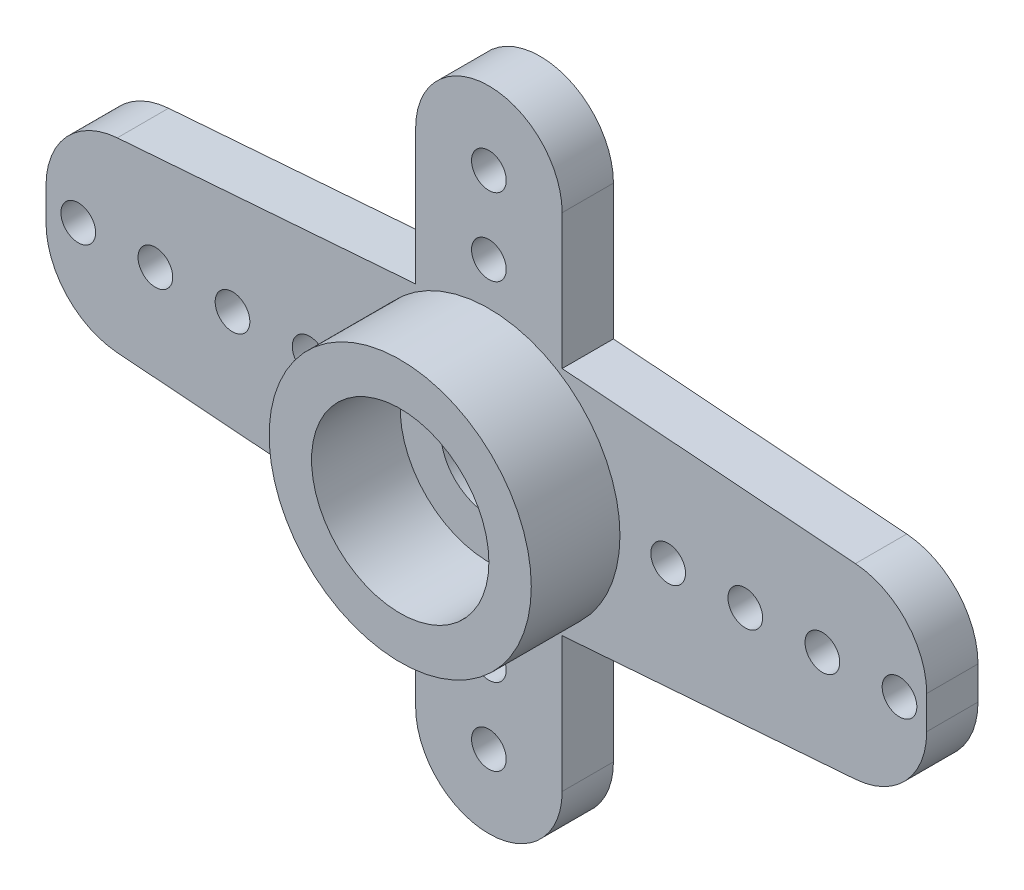
ISO-10303-21;
HEADER;
FILE_DESCRIPTION(('STEP AP214'),'2;1');
FILE_NAME('part.step','',(''),(''),'','','');
FILE_SCHEMA(('AUTOMOTIVE_DESIGN { 1 0 10303 214 1 1 1 1 }'));
ENDSEC;
DATA;
#1=APPLICATION_CONTEXT('core data for automotive mechanical design processes');
#2=APPLICATION_PROTOCOL_DEFINITION('international standard','automotive_design',2000,#1);
#3=PRODUCT_CONTEXT('',#1,'mechanical');
#4=PRODUCT('Part','Part','',(#3));
#5=PRODUCT_RELATED_PRODUCT_CATEGORY('part','',(#4));
#6=PRODUCT_DEFINITION_FORMATION('','',#4);
#7=PRODUCT_DEFINITION_CONTEXT('part definition',#1,'design');
#8=PRODUCT_DEFINITION('design','',#6,#7);
#9=PRODUCT_DEFINITION_SHAPE('','',#8);
#10=(LENGTH_UNIT() NAMED_UNIT(*) SI_UNIT(.MILLI.,.METRE.));
#11=(NAMED_UNIT(*) PLANE_ANGLE_UNIT() SI_UNIT($,.RADIAN.));
#12=(NAMED_UNIT(*) SI_UNIT($,.STERADIAN.) SOLID_ANGLE_UNIT());
#13=UNCERTAINTY_MEASURE_WITH_UNIT(LENGTH_MEASURE(1.E-05),#10,'distance_accuracy_value','');
#14=(GEOMETRIC_REPRESENTATION_CONTEXT(3) GLOBAL_UNCERTAINTY_ASSIGNED_CONTEXT((#13)) GLOBAL_UNIT_ASSIGNED_CONTEXT((#10,
#11,#12)) REPRESENTATION_CONTEXT('',''));
#15=CARTESIAN_POINT('',(0.,0.,0.));
#16=DIRECTION('',(0.,0.,1.));
#17=DIRECTION('',(1.,0.,0.));
#18=AXIS2_PLACEMENT_3D('',#15,#16,#17);
#19=CARTESIAN_POINT('',(0.,0.,0.));
#20=DIRECTION('',(0.,0.,1.));
#21=DIRECTION('',(1.,0.,0.));
#22=AXIS2_PLACEMENT_3D('',#19,#20,#21);
#23=CYLINDRICAL_SURFACE('',#22,1.25);
#24=CARTESIAN_POINT('',(0.,0.,1.33));
#25=DIRECTION('',(0.,0.,1.));
#26=DIRECTION('',(1.,0.,0.));
#27=AXIS2_PLACEMENT_3D('',#24,#25,#26);
#28=CIRCLE('',#27,1.25);
#29=CARTESIAN_POINT('',(1.25,0.,1.33));
#30=VERTEX_POINT('',#29);
#31=EDGE_CURVE('E276',#30,#30,#28,.T.);
#32=ORIENTED_EDGE('',*,*,#31,.T.);
#33=EDGE_LOOP('',(#32));
#34=FACE_BOUND('',#33,.T.);
#35=CARTESIAN_POINT('',(0.,0.,1.1));
#36=DIRECTION('',(0.,0.,-1.));
#37=DIRECTION('',(-1.,0.,0.));
#38=AXIS2_PLACEMENT_3D('',#35,#36,#37);
#39=CIRCLE('',#38,1.25);
#40=CARTESIAN_POINT('',(-1.25,0.,1.1));
#41=VERTEX_POINT('',#40);
#42=EDGE_CURVE('E272',#41,#41,#39,.F.);
#43=ORIENTED_EDGE('',*,*,#42,.F.);
#44=EDGE_LOOP('',(#43));
#45=FACE_BOUND('',#44,.T.);
#46=ADVANCED_FACE('F40',(#34,#45),#23,.F.);
#47=CARTESIAN_POINT('',(-16.7919145803729,-1.86962168683336,1.33));
#48=DIRECTION('',(0.0756877761988721,0.997131566311121,0.));
#49=DIRECTION('',(-0.997131566311121,0.0756877761988721,0.));
#50=AXIS2_PLACEMENT_3D('',#47,#48,#49);
#51=PLANE('',#50);
#52=DIRECTION('',(0.997131566311121,-0.0756877761988721,0.));
#53=VECTOR('',#52,1.);
#54=CARTESIAN_POINT('',(-16.7919145803729,-1.86962168683336,1.33));
#55=LINE('',#54,#53);
#56=CARTESIAN_POINT('',(-9.63847364933361,-2.41260724113023,1.33));
#57=VERTEX_POINT('',#56);
#58=CARTESIAN_POINT('',(-1.90000000000001,-3.,1.33));
#59=VERTEX_POINT('',#58);
#60=EDGE_CURVE('E155',#57,#59,#55,.T.);
#61=ORIENTED_EDGE('',*,*,#60,.F.);
#62=DIRECTION('',(0.,0.,-1.));
#63=VECTOR('',#62,1.);
#64=CARTESIAN_POINT('',(-9.63847364933361,-2.41260724113023,1.33));
#65=LINE('',#64,#63);
#66=CARTESIAN_POINT('',(-9.63847364933361,-2.41260724113023,0.));
#67=VERTEX_POINT('',#66);
#68=EDGE_CURVE('E278',#57,#67,#65,.T.);
#69=ORIENTED_EDGE('',*,*,#68,.T.);
#70=DIRECTION('',(0.997131566311121,-0.0756877761988721,0.));
#71=VECTOR('',#70,1.);
#72=CARTESIAN_POINT('',(-16.7919145803729,-1.86962168683336,0.));
#73=LINE('',#72,#71);
#74=CARTESIAN_POINT('',(-1.90000000000001,-3.,0.));
#75=VERTEX_POINT('',#74);
#76=EDGE_CURVE('E175',#67,#75,#73,.T.);
#77=ORIENTED_EDGE('',*,*,#76,.T.);
#78=DIRECTION('',(0.,0.,-1.));
#79=VECTOR('',#78,1.);
#80=CARTESIAN_POINT('',(-1.90000000000001,-3.,1.33));
#81=LINE('',#80,#79);
#82=EDGE_CURVE('E172',#59,#75,#81,.T.);
#83=ORIENTED_EDGE('',*,*,#82,.F.);
#84=EDGE_LOOP('',(#61,#69,#77,#83));
#85=FACE_BOUND('',#84,.T.);
#86=ADVANCED_FACE('F173',(#85),#51,.F.);
#87=CARTESIAN_POINT('',(-1.90000000000001,-3.,1.33));
#88=DIRECTION('',(1.,0.,0.));
#89=DIRECTION('',(0.,1.,0.));
#90=AXIS2_PLACEMENT_3D('',#87,#88,#89);
#91=PLANE('',#90);
#92=DIRECTION('',(0.,-1.,0.));
#93=VECTOR('',#92,1.);
#94=CARTESIAN_POINT('',(-1.90000000000001,-3.,0.));
#95=LINE('',#94,#93);
#96=CARTESIAN_POINT('',(-1.9,-6.5,0.));
#97=VERTEX_POINT('',#96);
#98=EDGE_CURVE('E218',#75,#97,#95,.T.);
#99=ORIENTED_EDGE('',*,*,#98,.T.);
#100=DIRECTION('',(0.,0.,-1.));
#101=VECTOR('',#100,1.);
#102=CARTESIAN_POINT('',(-1.9,-6.5,1.33));
#103=LINE('',#102,#101);
#104=CARTESIAN_POINT('',(-1.9,-6.5,1.33));
#105=VERTEX_POINT('',#104);
#106=EDGE_CURVE('E180',#105,#97,#103,.T.);
#107=ORIENTED_EDGE('',*,*,#106,.F.);
#108=DIRECTION('',(0.,-1.,0.));
#109=VECTOR('',#108,1.);
#110=CARTESIAN_POINT('',(-1.90000000000001,-3.,1.33));
#111=LINE('',#110,#109);
#112=EDGE_CURVE('E161',#59,#105,#111,.T.);
#113=ORIENTED_EDGE('',*,*,#112,.F.);
#114=ORIENTED_EDGE('',*,*,#82,.T.);
#115=EDGE_LOOP('',(#99,#107,#113,#114));
#116=FACE_BOUND('',#115,.T.);
#117=ADVANCED_FACE('F182',(#116),#91,.F.);
#118=CARTESIAN_POINT('',(0.,-6.5,1.33));
#119=DIRECTION('',(0.,0.,-1.));
#120=DIRECTION('',(-1.,0.,0.));
#121=AXIS2_PLACEMENT_3D('',#118,#119,#120);
#122=CYLINDRICAL_SURFACE('',#121,1.9);
#123=CARTESIAN_POINT('',(0.,-6.5,0.));
#124=DIRECTION('',(0.,0.,1.));
#125=DIRECTION('',(-1.,0.,0.));
#126=AXIS2_PLACEMENT_3D('',#123,#124,#125);
#127=CIRCLE('',#126,1.9);
#128=CARTESIAN_POINT('',(1.9,-6.5,0.));
#129=VERTEX_POINT('',#128);
#130=EDGE_CURVE('E222',#97,#129,#127,.T.);
#131=ORIENTED_EDGE('',*,*,#130,.T.);
#132=DIRECTION('',(0.,0.,-1.));
#133=VECTOR('',#132,1.);
#134=CARTESIAN_POINT('',(1.9,-6.5,1.33));
#135=LINE('',#134,#133);
#136=CARTESIAN_POINT('',(1.9,-6.5,1.33));
#137=VERTEX_POINT('',#136);
#138=EDGE_CURVE('E266',#137,#129,#135,.T.);
#139=ORIENTED_EDGE('',*,*,#138,.F.);
#140=CARTESIAN_POINT('',(0.,-6.5,1.33));
#141=DIRECTION('',(0.,0.,1.));
#142=DIRECTION('',(-1.,0.,0.));
#143=AXIS2_PLACEMENT_3D('',#140,#141,#142);
#144=CIRCLE('',#143,1.9);
#145=EDGE_CURVE('E186',#105,#137,#144,.T.);
#146=ORIENTED_EDGE('',*,*,#145,.F.);
#147=ORIENTED_EDGE('',*,*,#106,.T.);
#148=EDGE_LOOP('',(#131,#139,#146,#147));
#149=FACE_BOUND('',#148,.T.);
#150=ADVANCED_FACE('F346',(#149),#122,.T.);
#151=CARTESIAN_POINT('',(1.89999999999999,-3.,1.33));
#152=DIRECTION('',(-1.,0.,0.));
#153=DIRECTION('',(0.,-1.,0.));
#154=AXIS2_PLACEMENT_3D('',#151,#152,#153);
#155=PLANE('',#154);
#156=DIRECTION('',(0.,1.,0.));
#157=VECTOR('',#156,1.);
#158=CARTESIAN_POINT('',(1.89999999999999,-3.,0.));
#159=LINE('',#158,#157);
#160=CARTESIAN_POINT('',(1.89999999999999,-3.,0.));
#161=VERTEX_POINT('',#160);
#162=EDGE_CURVE('E225',#129,#161,#159,.T.);
#163=ORIENTED_EDGE('',*,*,#162,.T.);
#164=DIRECTION('',(0.,0.,-1.));
#165=VECTOR('',#164,1.);
#166=CARTESIAN_POINT('',(1.89999999999999,-3.,1.33));
#167=LINE('',#166,#165);
#168=CARTESIAN_POINT('',(1.89999999999999,-3.,1.33));
#169=VERTEX_POINT('',#168);
#170=EDGE_CURVE('E262',#169,#161,#167,.T.);
#171=ORIENTED_EDGE('',*,*,#170,.F.);
#172=DIRECTION('',(0.,1.,0.));
#173=VECTOR('',#172,1.);
#174=CARTESIAN_POINT('',(1.89999999999999,-3.,1.33));
#175=LINE('',#174,#173);
#176=EDGE_CURVE('E189',#137,#169,#175,.T.);
#177=ORIENTED_EDGE('',*,*,#176,.F.);
#178=ORIENTED_EDGE('',*,*,#138,.T.);
#179=EDGE_LOOP('',(#163,#171,#177,#178));
#180=FACE_BOUND('',#179,.T.);
#181=ADVANCED_FACE('F342',(#180),#155,.F.);
#182=CARTESIAN_POINT('',(16.7919145803729,-1.86962168683335,1.33));
#183=DIRECTION('',(-0.0756877761988722,0.997131566311121,0.));
#184=DIRECTION('',(-0.997131566311121,-0.0756877761988722,0.));
#185=AXIS2_PLACEMENT_3D('',#182,#183,#184);
#186=PLANE('',#185);
#187=DIRECTION('',(0.997131566311121,0.0756877761988722,0.));
#188=VECTOR('',#187,1.);
#189=CARTESIAN_POINT('',(16.7919145803729,-1.86962168683335,0.));
#190=LINE('',#189,#188);
#191=CARTESIAN_POINT('',(9.50732764089362,-2.42256194527514,0.));
#192=VERTEX_POINT('',#191);
#193=EDGE_CURVE('E228',#161,#192,#190,.T.);
#194=ORIENTED_EDGE('',*,*,#193,.T.);
#195=DIRECTION('',(0.,0.,1.));
#196=VECTOR('',#195,1.);
#197=CARTESIAN_POINT('',(9.50732764089362,-2.42256194527514,1.33));
#198=LINE('',#197,#196);
#199=CARTESIAN_POINT('',(9.50732764089362,-2.42256194527514,1.33));
#200=VERTEX_POINT('',#199);
#201=EDGE_CURVE('E311',#192,#200,#198,.T.);
#202=ORIENTED_EDGE('',*,*,#201,.T.);
#203=DIRECTION('',(0.997131566311121,0.0756877761988722,0.));
#204=VECTOR('',#203,1.);
#205=CARTESIAN_POINT('',(16.7919145803729,-1.86962168683335,1.33));
#206=LINE('',#205,#204);
#207=EDGE_CURVE('E195',#169,#200,#206,.T.);
#208=ORIENTED_EDGE('',*,*,#207,.F.);
#209=ORIENTED_EDGE('',*,*,#170,.T.);
#210=EDGE_LOOP('',(#194,#202,#208,#209));
#211=FACE_BOUND('',#210,.T.);
#212=ADVANCED_FACE('F337',(#211),#186,.F.);
#213=CARTESIAN_POINT('',(16.7919145803729,1.86962168683335,1.33));
#214=DIRECTION('',(-0.0756877761988718,-0.997131566311121,0.));
#215=DIRECTION('',(0.997131566311121,-0.0756877761988718,0.));
#216=AXIS2_PLACEMENT_3D('',#213,#214,#215);
#217=PLANE('',#216);
#218=DIRECTION('',(-0.997131566311121,0.0756877761988718,0.));
#219=VECTOR('',#218,1.);
#220=CARTESIAN_POINT('',(16.7919145803729,1.86962168683335,1.33));
#221=LINE('',#220,#219);
#222=CARTESIAN_POINT('',(9.50732764089362,2.42256194527514,1.33));
#223=VERTEX_POINT('',#222);
#224=CARTESIAN_POINT('',(1.89999999999999,3.,1.33));
#225=VERTEX_POINT('',#224);
#226=EDGE_CURVE('E199',#223,#225,#221,.T.);
#227=ORIENTED_EDGE('',*,*,#226,.F.);
#228=DIRECTION('',(0.,0.,-1.));
#229=VECTOR('',#228,1.);
#230=CARTESIAN_POINT('',(9.50732764089362,2.42256194527514,1.33));
#231=LINE('',#230,#229);
#232=CARTESIAN_POINT('',(9.50732764089362,2.42256194527514,0.));
#233=VERTEX_POINT('',#232);
#234=EDGE_CURVE('E11',#223,#233,#231,.T.);
#235=ORIENTED_EDGE('',*,*,#234,.T.);
#236=DIRECTION('',(-0.997131566311121,0.0756877761988718,0.));
#237=VECTOR('',#236,1.);
#238=CARTESIAN_POINT('',(16.7919145803729,1.86962168683335,0.));
#239=LINE('',#238,#237);
#240=CARTESIAN_POINT('',(1.89999999999999,3.,0.));
#241=VERTEX_POINT('',#240);
#242=EDGE_CURVE('E232',#233,#241,#239,.T.);
#243=ORIENTED_EDGE('',*,*,#242,.T.);
#244=DIRECTION('',(0.,0.,-1.));
#245=VECTOR('',#244,1.);
#246=CARTESIAN_POINT('',(1.89999999999999,3.,1.33));
#247=LINE('',#246,#245);
#248=EDGE_CURVE('E258',#225,#241,#247,.T.);
#249=ORIENTED_EDGE('',*,*,#248,.F.);
#250=EDGE_LOOP('',(#227,#235,#243,#249));
#251=FACE_BOUND('',#250,.T.);
#252=ADVANCED_FACE('F401',(#251),#217,.F.);
#253=CARTESIAN_POINT('',(1.89999999999999,3.,1.33));
#254=DIRECTION('',(-1.,0.,0.));
#255=DIRECTION('',(0.,-1.,0.));
#256=AXIS2_PLACEMENT_3D('',#253,#254,#255);
#257=PLANE('',#256);
#258=DIRECTION('',(0.,1.,0.));
#259=VECTOR('',#258,1.);
#260=CARTESIAN_POINT('',(1.89999999999999,3.,0.));
#261=LINE('',#260,#259);
#262=CARTESIAN_POINT('',(1.9,6.5,0.));
#263=VERTEX_POINT('',#262);
#264=EDGE_CURVE('E235',#241,#263,#261,.T.);
#265=ORIENTED_EDGE('',*,*,#264,.T.);
#266=DIRECTION('',(0.,0.,-1.));
#267=VECTOR('',#266,1.);
#268=CARTESIAN_POINT('',(1.9,6.5,1.33));
#269=LINE('',#268,#267);
#270=CARTESIAN_POINT('',(1.9,6.5,1.33));
#271=VERTEX_POINT('',#270);
#272=EDGE_CURVE('E254',#271,#263,#269,.T.);
#273=ORIENTED_EDGE('',*,*,#272,.F.);
#274=DIRECTION('',(0.,1.,0.));
#275=VECTOR('',#274,1.);
#276=CARTESIAN_POINT('',(1.89999999999999,3.,1.33));
#277=LINE('',#276,#275);
#278=EDGE_CURVE('E202',#225,#271,#277,.T.);
#279=ORIENTED_EDGE('',*,*,#278,.F.);
#280=ORIENTED_EDGE('',*,*,#248,.T.);
#281=EDGE_LOOP('',(#265,#273,#279,#280));
#282=FACE_BOUND('',#281,.T.);
#283=ADVANCED_FACE('F397',(#282),#257,.F.);
#284=CARTESIAN_POINT('',(0.,6.5,1.33));
#285=DIRECTION('',(0.,0.,-1.));
#286=DIRECTION('',(-1.,0.,0.));
#287=AXIS2_PLACEMENT_3D('',#284,#285,#286);
#288=CYLINDRICAL_SURFACE('',#287,1.9);
#289=CARTESIAN_POINT('',(0.,6.5,0.));
#290=DIRECTION('',(0.,0.,1.));
#291=DIRECTION('',(1.,0.,0.));
#292=AXIS2_PLACEMENT_3D('',#289,#290,#291);
#293=CIRCLE('',#292,1.9);
#294=CARTESIAN_POINT('',(-1.9,6.5,0.));
#295=VERTEX_POINT('',#294);
#296=EDGE_CURVE('E238',#263,#295,#293,.T.);
#297=ORIENTED_EDGE('',*,*,#296,.T.);
#298=DIRECTION('',(0.,0.,-1.));
#299=VECTOR('',#298,1.);
#300=CARTESIAN_POINT('',(-1.9,6.5,1.33));
#301=LINE('',#300,#299);
#302=CARTESIAN_POINT('',(-1.9,6.5,1.33));
#303=VERTEX_POINT('',#302);
#304=EDGE_CURVE('E250',#303,#295,#301,.T.);
#305=ORIENTED_EDGE('',*,*,#304,.F.);
#306=CARTESIAN_POINT('',(0.,6.5,1.33));
#307=DIRECTION('',(0.,0.,1.));
#308=DIRECTION('',(1.,0.,0.));
#309=AXIS2_PLACEMENT_3D('',#306,#307,#308);
#310=CIRCLE('',#309,1.9);
#311=EDGE_CURVE('E205',#271,#303,#310,.T.);
#312=ORIENTED_EDGE('',*,*,#311,.F.);
#313=ORIENTED_EDGE('',*,*,#272,.T.);
#314=EDGE_LOOP('',(#297,#305,#312,#313));
#315=FACE_BOUND('',#314,.T.);
#316=ADVANCED_FACE('F393',(#315),#288,.T.);
#317=CARTESIAN_POINT('',(-1.90000000000001,3.,1.33));
#318=DIRECTION('',(1.,0.,0.));
#319=DIRECTION('',(0.,1.,0.));
#320=AXIS2_PLACEMENT_3D('',#317,#318,#319);
#321=PLANE('',#320);
#322=DIRECTION('',(0.,-1.,0.));
#323=VECTOR('',#322,1.);
#324=CARTESIAN_POINT('',(-1.90000000000001,3.,0.));
#325=LINE('',#324,#323);
#326=CARTESIAN_POINT('',(-1.90000000000001,3.,0.));
#327=VERTEX_POINT('',#326);
#328=EDGE_CURVE('E241',#295,#327,#325,.T.);
#329=ORIENTED_EDGE('',*,*,#328,.T.);
#330=DIRECTION('',(0.,0.,-1.));
#331=VECTOR('',#330,1.);
#332=CARTESIAN_POINT('',(-1.90000000000001,3.,1.33));
#333=LINE('',#332,#331);
#334=CARTESIAN_POINT('',(-1.90000000000001,3.,1.33));
#335=VERTEX_POINT('',#334);
#336=EDGE_CURVE('E215',#335,#327,#333,.T.);
#337=ORIENTED_EDGE('',*,*,#336,.F.);
#338=DIRECTION('',(0.,-1.,0.));
#339=VECTOR('',#338,1.);
#340=CARTESIAN_POINT('',(-1.90000000000001,3.,1.33));
#341=LINE('',#340,#339);
#342=EDGE_CURVE('E208',#303,#335,#341,.T.);
#343=ORIENTED_EDGE('',*,*,#342,.F.);
#344=ORIENTED_EDGE('',*,*,#304,.T.);
#345=EDGE_LOOP('',(#329,#337,#343,#344));
#346=FACE_BOUND('',#345,.T.);
#347=ADVANCED_FACE('F389',(#346),#321,.F.);
#348=CARTESIAN_POINT('',(-16.7919145803729,1.86962168683335,1.33));
#349=DIRECTION('',(0.0756877761988721,-0.997131566311121,0.));
#350=DIRECTION('',(0.997131566311121,0.0756877761988721,0.));
#351=AXIS2_PLACEMENT_3D('',#348,#349,#350);
#352=PLANE('',#351);
#353=DIRECTION('',(-0.997131566311121,-0.0756877761988721,0.));
#354=VECTOR('',#353,1.);
#355=CARTESIAN_POINT('',(-16.7919145803729,1.86962168683335,0.));
#356=LINE('',#355,#354);
#357=CARTESIAN_POINT('',(-9.63847364933361,2.41260724113022,0.));
#358=VERTEX_POINT('',#357);
#359=EDGE_CURVE('E169',#327,#358,#356,.T.);
#360=ORIENTED_EDGE('',*,*,#359,.T.);
#361=DIRECTION('',(0.,0.,1.));
#362=VECTOR('',#361,1.);
#363=CARTESIAN_POINT('',(-9.63847364933361,2.41260724113022,1.33));
#364=LINE('',#363,#362);
#365=CARTESIAN_POINT('',(-9.63847364933361,2.41260724113022,1.33));
#366=VERTEX_POINT('',#365);
#367=EDGE_CURVE('E308',#358,#366,#364,.T.);
#368=ORIENTED_EDGE('',*,*,#367,.T.);
#369=DIRECTION('',(-0.997131566311121,-0.0756877761988721,0.));
#370=VECTOR('',#369,1.);
#371=CARTESIAN_POINT('',(-16.7919145803729,1.86962168683335,1.33));
#372=LINE('',#371,#370);
#373=EDGE_CURVE('E211',#335,#366,#372,.T.);
#374=ORIENTED_EDGE('',*,*,#373,.F.);
#375=ORIENTED_EDGE('',*,*,#336,.T.);
#376=EDGE_LOOP('',(#360,#368,#374,#375));
#377=FACE_BOUND('',#376,.T.);
#378=ADVANCED_FACE('F383',(#377),#352,.F.);
#379=CARTESIAN_POINT('',(-16.65,0.,1.33));
#380=DIRECTION('',(0.,0.,1.));
#381=DIRECTION('',(1.,0.,0.));
#382=AXIS2_PLACEMENT_3D('',#379,#380,#381);
#383=PLANE('',#382);
#384=DIRECTION('',(0.,-1.,0.));
#385=VECTOR('',#384,1.);
#386=CARTESIAN_POINT('',(-11.4870980969359,-3.16862126096254,1.33));
#387=LINE('',#386,#385);
#388=CARTESIAN_POINT('',(-11.4870980969359,0.418344108507978,1.33));
#389=VERTEX_POINT('',#388);
#390=CARTESIAN_POINT('',(-11.4870980969359,-0.418344108507985,1.33));
#391=VERTEX_POINT('',#390);
#392=EDGE_CURVE('E332',#389,#391,#387,.T.);
#393=ORIENTED_EDGE('',*,*,#392,.T.);
#394=CARTESIAN_POINT('',(-9.48709809693587,-0.418344108507985,1.33));
#395=DIRECTION('',(0.,0.,1.));
#396=DIRECTION('',(1.,0.,0.));
#397=AXIS2_PLACEMENT_3D('',#394,#395,#396);
#398=CIRCLE('',#397,2.);
#399=EDGE_CURVE('E164',#391,#57,#398,.T.);
#400=ORIENTED_EDGE('',*,*,#399,.T.);
#401=ORIENTED_EDGE('',*,*,#60,.T.);
#402=ORIENTED_EDGE('',*,*,#112,.T.);
#403=ORIENTED_EDGE('',*,*,#145,.T.);
#404=ORIENTED_EDGE('',*,*,#176,.T.);
#405=ORIENTED_EDGE('',*,*,#207,.T.);
#406=CARTESIAN_POINT('',(9.35595208849588,-0.428298812652896,1.33));
#407=DIRECTION('',(0.,0.,1.));
#408=DIRECTION('',(1.,0.,0.));
#409=AXIS2_PLACEMENT_3D('',#406,#407,#408);
#410=CIRCLE('',#409,2.);
#411=CARTESIAN_POINT('',(11.3559520884959,-0.428298812652896,1.33));
#412=VERTEX_POINT('',#411);
#413=EDGE_CURVE('E56',#200,#412,#410,.T.);
#414=ORIENTED_EDGE('',*,*,#413,.T.);
#415=DIRECTION('',(0.,1.,0.));
#416=VECTOR('',#415,1.);
#417=CARTESIAN_POINT('',(11.3559520884959,-3.73506978721914,1.33));
#418=LINE('',#417,#416);
#419=CARTESIAN_POINT('',(11.3559520884959,0.428298812652893,1.33));
#420=VERTEX_POINT('',#419);
#421=EDGE_CURVE('E325',#412,#420,#418,.T.);
#422=ORIENTED_EDGE('',*,*,#421,.T.);
#423=CARTESIAN_POINT('',(9.35595208849588,0.428298812652893,1.33));
#424=DIRECTION('',(0.,0.,1.));
#425=DIRECTION('',(1.,0.,0.));
#426=AXIS2_PLACEMENT_3D('',#423,#424,#425);
#427=CIRCLE('',#426,2.);
#428=EDGE_CURVE('E299',#420,#223,#427,.T.);
#429=ORIENTED_EDGE('',*,*,#428,.T.);
#430=ORIENTED_EDGE('',*,*,#226,.T.);
#431=ORIENTED_EDGE('',*,*,#278,.T.);
#432=ORIENTED_EDGE('',*,*,#311,.T.);
#433=ORIENTED_EDGE('',*,*,#342,.T.);
#434=ORIENTED_EDGE('',*,*,#373,.T.);
#435=CARTESIAN_POINT('',(-9.48709809693587,0.418344108507978,1.33));
#436=DIRECTION('',(0.,0.,1.));
#437=DIRECTION('',(1.,0.,0.));
#438=AXIS2_PLACEMENT_3D('',#435,#436,#437);
#439=CIRCLE('',#438,2.);
#440=EDGE_CURVE('E64',#366,#389,#439,.T.);
#441=ORIENTED_EDGE('',*,*,#440,.T.);
#442=EDGE_LOOP('',(#393,#400,#401,#402,#403,#404,#405,#414,#422,#429,#430,#431,#432,#433,#434,#441));
#443=FACE_BOUND('',#442,.T.);
#444=CARTESIAN_POINT('',(0.,6.5,1.33));
#445=DIRECTION('',(0.,0.,1.));
#446=DIRECTION('',(1.,0.,0.));
#447=AXIS2_PLACEMENT_3D('',#444,#445,#446);
#448=CIRCLE('',#447,0.45);
#449=CARTESIAN_POINT('',(0.449999999999998,6.5,1.33));
#450=VERTEX_POINT('',#449);
#451=EDGE_CURVE('E728',#450,#450,#448,.T.);
#452=ORIENTED_EDGE('',*,*,#451,.F.);
#453=EDGE_LOOP('',(#452));
#454=FACE_BOUND('',#453,.T.);
#455=CARTESIAN_POINT('',(10.65,0.,1.33));
#456=DIRECTION('',(0.,0.,1.));
#457=DIRECTION('',(-1.,0.,0.));
#458=AXIS2_PLACEMENT_3D('',#455,#456,#457);
#459=CIRCLE('',#458,0.449999999999998);
#460=CARTESIAN_POINT('',(10.2,0.,1.33));
#461=VERTEX_POINT('',#460);
#462=EDGE_CURVE('E778',#461,#461,#459,.T.);
#463=ORIENTED_EDGE('',*,*,#462,.F.);
#464=EDGE_LOOP('',(#463));
#465=FACE_BOUND('',#464,.T.);
#466=CARTESIAN_POINT('',(8.65000000000001,0.,1.33));
#467=DIRECTION('',(0.,0.,1.));
#468=DIRECTION('',(-1.,0.,0.));
#469=AXIS2_PLACEMENT_3D('',#466,#467,#468);
#470=CIRCLE('',#469,0.449999999999998);
#471=CARTESIAN_POINT('',(8.20000000000001,0.,1.33));
#472=VERTEX_POINT('',#471);
#473=EDGE_CURVE('E770',#472,#472,#470,.T.);
#474=ORIENTED_EDGE('',*,*,#473,.F.);
#475=EDGE_LOOP('',(#474));
#476=FACE_BOUND('',#475,.T.);
#477=CARTESIAN_POINT('',(6.65,0.,1.33));
#478=DIRECTION('',(0.,0.,1.));
#479=DIRECTION('',(-1.,0.,0.));
#480=AXIS2_PLACEMENT_3D('',#477,#478,#479);
#481=CIRCLE('',#480,0.449999999999998);
#482=CARTESIAN_POINT('',(6.20000000000001,0.,1.33));
#483=VERTEX_POINT('',#482);
#484=EDGE_CURVE('E762',#483,#483,#481,.T.);
#485=ORIENTED_EDGE('',*,*,#484,.F.);
#486=EDGE_LOOP('',(#485));
#487=FACE_BOUND('',#486,.T.);
#488=CARTESIAN_POINT('',(4.65,0.,1.33));
#489=DIRECTION('',(0.,0.,1.));
#490=DIRECTION('',(-1.,0.,0.));
#491=AXIS2_PLACEMENT_3D('',#488,#489,#490);
#492=CIRCLE('',#491,0.449999999999998);
#493=CARTESIAN_POINT('',(4.20000000000001,0.,1.33));
#494=VERTEX_POINT('',#493);
#495=EDGE_CURVE('E754',#494,#494,#492,.T.);
#496=ORIENTED_EDGE('',*,*,#495,.F.);
#497=EDGE_LOOP('',(#496));
#498=FACE_BOUND('',#497,.T.);
#499=CARTESIAN_POINT('',(0.,-6.5,1.33));
#500=DIRECTION('',(0.,0.,1.));
#501=DIRECTION('',(-1.,0.,0.));
#502=AXIS2_PLACEMENT_3D('',#499,#500,#501);
#503=CIRCLE('',#502,0.45);
#504=CARTESIAN_POINT('',(-0.449999999999997,-6.5,1.33));
#505=VERTEX_POINT('',#504);
#506=EDGE_CURVE('E746',#505,#505,#503,.T.);
#507=ORIENTED_EDGE('',*,*,#506,.F.);
#508=EDGE_LOOP('',(#507));
#509=FACE_BOUND('',#508,.T.);
#510=CARTESIAN_POINT('',(0.,-4.5,1.33));
#511=DIRECTION('',(0.,0.,1.));
#512=DIRECTION('',(-1.,0.,0.));
#513=AXIS2_PLACEMENT_3D('',#510,#511,#512);
#514=CIRCLE('',#513,0.45);
#515=CARTESIAN_POINT('',(-0.449999999999978,-4.5,1.33));
#516=VERTEX_POINT('',#515);
#517=EDGE_CURVE('E738',#516,#516,#514,.T.);
#518=ORIENTED_EDGE('',*,*,#517,.F.);
#519=EDGE_LOOP('',(#518));
#520=FACE_BOUND('',#519,.T.);
#521=CARTESIAN_POINT('',(0.,4.5,1.33));
#522=DIRECTION('',(0.,0.,1.));
#523=DIRECTION('',(1.,0.,0.));
#524=AXIS2_PLACEMENT_3D('',#521,#522,#523);
#525=CIRCLE('',#524,0.45);
#526=CARTESIAN_POINT('',(0.450000000000019,4.5,1.33));
#527=VERTEX_POINT('',#526);
#528=EDGE_CURVE('E786',#527,#527,#525,.T.);
#529=ORIENTED_EDGE('',*,*,#528,.F.);
#530=EDGE_LOOP('',(#529));
#531=FACE_BOUND('',#530,.T.);
#532=CARTESIAN_POINT('',(-10.65,0.,1.33));
#533=DIRECTION('',(0.,0.,1.));
#534=DIRECTION('',(1.,0.,0.));
#535=AXIS2_PLACEMENT_3D('',#532,#533,#534);
#536=CIRCLE('',#535,0.449999999999998);
#537=CARTESIAN_POINT('',(-10.2,0.,1.33));
#538=VERTEX_POINT('',#537);
#539=EDGE_CURVE('E787',#538,#538,#536,.T.);
#540=ORIENTED_EDGE('',*,*,#539,.F.);
#541=EDGE_LOOP('',(#540));
#542=FACE_BOUND('',#541,.T.);
#543=CARTESIAN_POINT('',(-8.65000000000001,0.,1.33));
#544=DIRECTION('',(0.,0.,1.));
#545=DIRECTION('',(1.,0.,0.));
#546=AXIS2_PLACEMENT_3D('',#543,#544,#545);
#547=CIRCLE('',#546,0.449999999999998);
#548=CARTESIAN_POINT('',(-8.20000000000001,0.,1.33));
#549=VERTEX_POINT('',#548);
#550=EDGE_CURVE('E795',#549,#549,#547,.T.);
#551=ORIENTED_EDGE('',*,*,#550,.F.);
#552=EDGE_LOOP('',(#551));
#553=FACE_BOUND('',#552,.T.);
#554=CARTESIAN_POINT('',(-6.65,0.,1.33));
#555=DIRECTION('',(0.,0.,1.));
#556=DIRECTION('',(1.,0.,0.));
#557=AXIS2_PLACEMENT_3D('',#554,#555,#556);
#558=CIRCLE('',#557,0.449999999999998);
#559=CARTESIAN_POINT('',(-6.20000000000001,0.,1.33));
#560=VERTEX_POINT('',#559);
#561=EDGE_CURVE('E803',#560,#560,#558,.T.);
#562=ORIENTED_EDGE('',*,*,#561,.F.);
#563=EDGE_LOOP('',(#562));
#564=FACE_BOUND('',#563,.T.);
#565=CARTESIAN_POINT('',(-4.65,0.,1.33));
#566=DIRECTION('',(0.,0.,1.));
#567=DIRECTION('',(1.,0.,0.));
#568=AXIS2_PLACEMENT_3D('',#565,#566,#567);
#569=CIRCLE('',#568,0.449999999999998);
#570=CARTESIAN_POINT('',(-4.20000000000001,0.,1.33));
#571=VERTEX_POINT('',#570);
#572=EDGE_CURVE('E737',#571,#571,#569,.T.);
#573=ORIENTED_EDGE('',*,*,#572,.F.);
#574=EDGE_LOOP('',(#573));
#575=FACE_BOUND('',#574,.T.);
#576=CARTESIAN_POINT('',(0.,0.,1.33));
#577=DIRECTION('',(0.,0.,1.));
#578=DIRECTION('',(1.,0.,0.));
#579=AXIS2_PLACEMENT_3D('',#576,#577,#578);
#580=CIRCLE('',#579,3.4);
#581=CARTESIAN_POINT('',(3.4,0.,1.33));
#582=VERTEX_POINT('',#581);
#583=EDGE_CURVE('E179',#582,#582,#580,.T.);
#584=ORIENTED_EDGE('',*,*,#583,.F.);
#585=EDGE_LOOP('',(#584));
#586=FACE_BOUND('',#585,.T.);
#587=ADVANCED_FACE('F158',(#443,#454,#465,#476,#487,#498,#509,#520,#531,#542,#553,#564,#575,
#586),#383,.T.);
#588=CARTESIAN_POINT('',(-16.65,0.,0.));
#589=DIRECTION('',(0.,0.,1.));
#590=DIRECTION('',(1.,0.,0.));
#591=AXIS2_PLACEMENT_3D('',#588,#589,#590);
#592=PLANE('',#591);
#593=CARTESIAN_POINT('',(0.,6.5,0.));
#594=DIRECTION('',(0.,0.,1.));
#595=DIRECTION('',(1.,0.,0.));
#596=AXIS2_PLACEMENT_3D('',#593,#594,#595);
#597=CIRCLE('',#596,0.45);
#598=CARTESIAN_POINT('',(0.449999999999998,6.5,0.));
#599=VERTEX_POINT('',#598);
#600=EDGE_CURVE('E723',#599,#599,#597,.T.);
#601=ORIENTED_EDGE('',*,*,#600,.T.);
#602=EDGE_LOOP('',(#601));
#603=FACE_BOUND('',#602,.T.);
#604=CARTESIAN_POINT('',(10.65,0.,0.));
#605=DIRECTION('',(0.,0.,1.));
#606=DIRECTION('',(-1.,0.,0.));
#607=AXIS2_PLACEMENT_3D('',#604,#605,#606);
#608=CIRCLE('',#607,0.449999999999998);
#609=CARTESIAN_POINT('',(10.2,0.,0.));
#610=VERTEX_POINT('',#609);
#611=EDGE_CURVE('E774',#610,#610,#608,.T.);
#612=ORIENTED_EDGE('',*,*,#611,.T.);
#613=EDGE_LOOP('',(#612));
#614=FACE_BOUND('',#613,.T.);
#615=CARTESIAN_POINT('',(8.65000000000001,0.,0.));
#616=DIRECTION('',(0.,0.,1.));
#617=DIRECTION('',(-1.,0.,0.));
#618=AXIS2_PLACEMENT_3D('',#615,#616,#617);
#619=CIRCLE('',#618,0.449999999999998);
#620=CARTESIAN_POINT('',(8.20000000000001,0.,0.));
#621=VERTEX_POINT('',#620);
#622=EDGE_CURVE('E766',#621,#621,#619,.T.);
#623=ORIENTED_EDGE('',*,*,#622,.T.);
#624=EDGE_LOOP('',(#623));
#625=FACE_BOUND('',#624,.T.);
#626=CARTESIAN_POINT('',(6.65,0.,0.));
#627=DIRECTION('',(0.,0.,1.));
#628=DIRECTION('',(-1.,0.,0.));
#629=AXIS2_PLACEMENT_3D('',#626,#627,#628);
#630=CIRCLE('',#629,0.449999999999998);
#631=CARTESIAN_POINT('',(6.20000000000001,0.,0.));
#632=VERTEX_POINT('',#631);
#633=EDGE_CURVE('E758',#632,#632,#630,.T.);
#634=ORIENTED_EDGE('',*,*,#633,.T.);
#635=EDGE_LOOP('',(#634));
#636=FACE_BOUND('',#635,.T.);
#637=CARTESIAN_POINT('',(4.65,0.,0.));
#638=DIRECTION('',(0.,0.,1.));
#639=DIRECTION('',(-1.,0.,0.));
#640=AXIS2_PLACEMENT_3D('',#637,#638,#639);
#641=CIRCLE('',#640,0.449999999999998);
#642=CARTESIAN_POINT('',(4.20000000000001,0.,0.));
#643=VERTEX_POINT('',#642);
#644=EDGE_CURVE('E750',#643,#643,#641,.T.);
#645=ORIENTED_EDGE('',*,*,#644,.T.);
#646=EDGE_LOOP('',(#645));
#647=FACE_BOUND('',#646,.T.);
#648=CARTESIAN_POINT('',(0.,-6.5,0.));
#649=DIRECTION('',(0.,0.,1.));
#650=DIRECTION('',(-1.,0.,0.));
#651=AXIS2_PLACEMENT_3D('',#648,#649,#650);
#652=CIRCLE('',#651,0.45);
#653=CARTESIAN_POINT('',(-0.449999999999997,-6.5,0.));
#654=VERTEX_POINT('',#653);
#655=EDGE_CURVE('E742',#654,#654,#652,.T.);
#656=ORIENTED_EDGE('',*,*,#655,.T.);
#657=EDGE_LOOP('',(#656));
#658=FACE_BOUND('',#657,.T.);
#659=CARTESIAN_POINT('',(0.,-4.5,0.));
#660=DIRECTION('',(0.,0.,1.));
#661=DIRECTION('',(-1.,0.,0.));
#662=AXIS2_PLACEMENT_3D('',#659,#660,#661);
#663=CIRCLE('',#662,0.45);
#664=CARTESIAN_POINT('',(-0.449999999999978,-4.5,0.));
#665=VERTEX_POINT('',#664);
#666=EDGE_CURVE('E733',#665,#665,#663,.T.);
#667=ORIENTED_EDGE('',*,*,#666,.T.);
#668=EDGE_LOOP('',(#667));
#669=FACE_BOUND('',#668,.T.);
#670=CARTESIAN_POINT('',(0.,4.5,0.));
#671=DIRECTION('',(0.,0.,1.));
#672=DIRECTION('',(1.,0.,0.));
#673=AXIS2_PLACEMENT_3D('',#670,#671,#672);
#674=CIRCLE('',#673,0.45);
#675=CARTESIAN_POINT('',(0.450000000000019,4.5,0.));
#676=VERTEX_POINT('',#675);
#677=EDGE_CURVE('E732',#676,#676,#674,.T.);
#678=ORIENTED_EDGE('',*,*,#677,.T.);
#679=EDGE_LOOP('',(#678));
#680=FACE_BOUND('',#679,.T.);
#681=CARTESIAN_POINT('',(-10.65,0.,0.));
#682=DIRECTION('',(0.,0.,1.));
#683=DIRECTION('',(1.,0.,0.));
#684=AXIS2_PLACEMENT_3D('',#681,#682,#683);
#685=CIRCLE('',#684,0.449999999999998);
#686=CARTESIAN_POINT('',(-10.2,0.,0.));
#687=VERTEX_POINT('',#686);
#688=EDGE_CURVE('E782',#687,#687,#685,.T.);
#689=ORIENTED_EDGE('',*,*,#688,.T.);
#690=EDGE_LOOP('',(#689));
#691=FACE_BOUND('',#690,.T.);
#692=CARTESIAN_POINT('',(-8.65000000000001,0.,0.));
#693=DIRECTION('',(0.,0.,1.));
#694=DIRECTION('',(1.,0.,0.));
#695=AXIS2_PLACEMENT_3D('',#692,#693,#694);
#696=CIRCLE('',#695,0.449999999999998);
#697=CARTESIAN_POINT('',(-8.20000000000001,0.,0.));
#698=VERTEX_POINT('',#697);
#699=EDGE_CURVE('E791',#698,#698,#696,.T.);
#700=ORIENTED_EDGE('',*,*,#699,.T.);
#701=EDGE_LOOP('',(#700));
#702=FACE_BOUND('',#701,.T.);
#703=CARTESIAN_POINT('',(-6.65,0.,0.));
#704=DIRECTION('',(0.,0.,1.));
#705=DIRECTION('',(1.,0.,0.));
#706=AXIS2_PLACEMENT_3D('',#703,#704,#705);
#707=CIRCLE('',#706,0.449999999999998);
#708=CARTESIAN_POINT('',(-6.20000000000001,0.,0.));
#709=VERTEX_POINT('',#708);
#710=EDGE_CURVE('E799',#709,#709,#707,.T.);
#711=ORIENTED_EDGE('',*,*,#710,.T.);
#712=EDGE_LOOP('',(#711));
#713=FACE_BOUND('',#712,.T.);
#714=CARTESIAN_POINT('',(-4.65,0.,0.));
#715=DIRECTION('',(0.,0.,1.));
#716=DIRECTION('',(1.,0.,0.));
#717=AXIS2_PLACEMENT_3D('',#714,#715,#716);
#718=CIRCLE('',#717,0.449999999999998);
#719=CARTESIAN_POINT('',(-4.20000000000001,0.,0.));
#720=VERTEX_POINT('',#719);
#721=EDGE_CURVE('E807',#720,#720,#718,.T.);
#722=ORIENTED_EDGE('',*,*,#721,.T.);
#723=EDGE_LOOP('',(#722));
#724=FACE_BOUND('',#723,.T.);
#725=CARTESIAN_POINT('',(0.,0.,0.));
#726=DIRECTION('',(0.,0.,-1.));
#727=DIRECTION('',(-1.,0.,0.));
#728=AXIS2_PLACEMENT_3D('',#725,#726,#727);
#729=CIRCLE('',#728,2.35);
#730=CARTESIAN_POINT('',(-2.35,0.,0.));
#731=VERTEX_POINT('',#730);
#732=EDGE_CURVE('E727',#731,#731,#729,.T.);
#733=ORIENTED_EDGE('',*,*,#732,.F.);
#734=EDGE_LOOP('',(#733));
#735=FACE_BOUND('',#734,.T.);
#736=ORIENTED_EDGE('',*,*,#76,.F.);
#737=CARTESIAN_POINT('',(-9.48709809693587,-0.418344108507985,0.));
#738=DIRECTION('',(0.,0.,1.));
#739=DIRECTION('',(1.,0.,0.));
#740=AXIS2_PLACEMENT_3D('',#737,#738,#739);
#741=CIRCLE('',#740,2.);
#742=CARTESIAN_POINT('',(-11.4870980969359,-0.418344108507985,0.));
#743=VERTEX_POINT('',#742);
#744=EDGE_CURVE('E290',#67,#743,#741,.F.);
#745=ORIENTED_EDGE('',*,*,#744,.T.);
#746=DIRECTION('',(0.,-1.,0.));
#747=VECTOR('',#746,1.);
#748=CARTESIAN_POINT('',(-11.4870980969359,-3.16862126096254,0.));
#749=LINE('',#748,#747);
#750=CARTESIAN_POINT('',(-11.4870980969359,0.418344108507978,0.));
#751=VERTEX_POINT('',#750);
#752=EDGE_CURVE('E716',#751,#743,#749,.T.);
#753=ORIENTED_EDGE('',*,*,#752,.F.);
#754=CARTESIAN_POINT('',(-9.48709809693587,0.418344108507978,0.));
#755=DIRECTION('',(0.,0.,1.));
#756=DIRECTION('',(1.,0.,0.));
#757=AXIS2_PLACEMENT_3D('',#754,#755,#756);
#758=CIRCLE('',#757,2.);
#759=EDGE_CURVE('E287',#751,#358,#758,.F.);
#760=ORIENTED_EDGE('',*,*,#759,.T.);
#761=ORIENTED_EDGE('',*,*,#359,.F.);
#762=ORIENTED_EDGE('',*,*,#328,.F.);
#763=ORIENTED_EDGE('',*,*,#296,.F.);
#764=ORIENTED_EDGE('',*,*,#264,.F.);
#765=ORIENTED_EDGE('',*,*,#242,.F.);
#766=CARTESIAN_POINT('',(9.35595208849588,0.428298812652893,0.));
#767=DIRECTION('',(0.,0.,1.));
#768=DIRECTION('',(1.,0.,0.));
#769=AXIS2_PLACEMENT_3D('',#766,#767,#768);
#770=CIRCLE('',#769,2.);
#771=CARTESIAN_POINT('',(11.3559520884959,0.428298812652893,0.));
#772=VERTEX_POINT('',#771);
#773=EDGE_CURVE('E281',#233,#772,#770,.F.);
#774=ORIENTED_EDGE('',*,*,#773,.T.);
#775=DIRECTION('',(0.,1.,0.));
#776=VECTOR('',#775,1.);
#777=CARTESIAN_POINT('',(11.3559520884959,-3.73506978721914,0.));
#778=LINE('',#777,#776);
#779=CARTESIAN_POINT('',(11.3559520884959,-0.428298812652896,0.));
#780=VERTEX_POINT('',#779);
#781=EDGE_CURVE('E322',#780,#772,#778,.T.);
#782=ORIENTED_EDGE('',*,*,#781,.F.);
#783=CARTESIAN_POINT('',(9.35595208849588,-0.428298812652896,0.));
#784=DIRECTION('',(0.,0.,1.));
#785=DIRECTION('',(1.,0.,0.));
#786=AXIS2_PLACEMENT_3D('',#783,#784,#785);
#787=CIRCLE('',#786,2.);
#788=EDGE_CURVE('E284',#780,#192,#787,.F.);
#789=ORIENTED_EDGE('',*,*,#788,.T.);
#790=ORIENTED_EDGE('',*,*,#193,.F.);
#791=ORIENTED_EDGE('',*,*,#162,.F.);
#792=ORIENTED_EDGE('',*,*,#130,.F.);
#793=ORIENTED_EDGE('',*,*,#98,.F.);
#794=EDGE_LOOP('',(#736,#745,#753,#760,#761,#762,#763,#764,#765,#774,#782,#789,#790,#791,#792,#793));
#795=FACE_BOUND('',#794,.T.);
#796=ADVANCED_FACE('F328',(#603,#614,#625,#636,#647,#658,#669,#680,#691,#702,#713,#724,#735,
#795),#592,.F.);
#797=CARTESIAN_POINT('',(0.,0.,-9.61665222413705));
#798=DIRECTION('',(0.,0.,1.));
#799=DIRECTION('',(1.,0.,0.));
#800=AXIS2_PLACEMENT_3D('',#797,#798,#799);
#801=CYLINDRICAL_SURFACE('',#800,3.4);
#802=ORIENTED_EDGE('',*,*,#583,.T.);
#803=EDGE_LOOP('',(#802));
#804=FACE_BOUND('',#803,.T.);
#805=CARTESIAN_POINT('',(0.,0.,3.63));
#806=DIRECTION('',(0.,0.,1.));
#807=DIRECTION('',(1.,0.,0.));
#808=AXIS2_PLACEMENT_3D('',#805,#806,#807);
#809=CIRCLE('',#808,3.4);
#810=CARTESIAN_POINT('',(3.4,0.,3.63));
#811=VERTEX_POINT('',#810);
#812=EDGE_CURVE('E832',#811,#811,#809,.T.);
#813=ORIENTED_EDGE('',*,*,#812,.F.);
#814=EDGE_LOOP('',(#813));
#815=FACE_BOUND('',#814,.T.);
#816=ADVANCED_FACE('F376',(#804,#815),#801,.T.);
#817=CARTESIAN_POINT('',(0.,0.,-9.61665222413705));
#818=DIRECTION('',(0.,0.,1.));
#819=DIRECTION('',(1.,0.,0.));
#820=AXIS2_PLACEMENT_3D('',#817,#818,#819);
#821=CYLINDRICAL_SURFACE('',#820,2.3);
#822=CARTESIAN_POINT('',(0.,0.,1.33));
#823=DIRECTION('',(0.,0.,1.));
#824=DIRECTION('',(1.,0.,0.));
#825=AXIS2_PLACEMENT_3D('',#822,#823,#824);
#826=CIRCLE('',#825,2.3);
#827=CARTESIAN_POINT('',(2.3,0.,1.33));
#828=VERTEX_POINT('',#827);
#829=EDGE_CURVE('E219',#828,#828,#826,.T.);
#830=ORIENTED_EDGE('',*,*,#829,.F.);
#831=EDGE_LOOP('',(#830));
#832=FACE_BOUND('',#831,.T.);
#833=CARTESIAN_POINT('',(0.,0.,3.63));
#834=DIRECTION('',(0.,0.,1.));
#835=DIRECTION('',(1.,0.,0.));
#836=AXIS2_PLACEMENT_3D('',#833,#834,#835);
#837=CIRCLE('',#836,2.3);
#838=CARTESIAN_POINT('',(2.3,0.,3.63));
#839=VERTEX_POINT('',#838);
#840=EDGE_CURVE('E828',#839,#839,#837,.T.);
#841=ORIENTED_EDGE('',*,*,#840,.T.);
#842=EDGE_LOOP('',(#841));
#843=FACE_BOUND('',#842,.T.);
#844=ADVANCED_FACE('F372',(#832,#843),#821,.F.);
#845=CARTESIAN_POINT('',(0.,0.,3.63));
#846=DIRECTION('',(0.,0.,1.));
#847=DIRECTION('',(1.,0.,0.));
#848=AXIS2_PLACEMENT_3D('',#845,#846,#847);
#849=PLANE('',#848);
#850=ORIENTED_EDGE('',*,*,#812,.T.);
#851=EDGE_LOOP('',(#850));
#852=FACE_BOUND('',#851,.T.);
#853=ORIENTED_EDGE('',*,*,#840,.F.);
#854=EDGE_LOOP('',(#853));
#855=FACE_BOUND('',#854,.T.);
#856=ADVANCED_FACE('F368',(#852,#855),#849,.T.);
#857=ORIENTED_EDGE('',*,*,#31,.F.);
#858=EDGE_LOOP('',(#857));
#859=FACE_BOUND('',#858,.T.);
#860=ORIENTED_EDGE('',*,*,#829,.T.);
#861=EDGE_LOOP('',(#860));
#862=FACE_BOUND('',#861,.T.);
#863=ADVANCED_FACE('F371',(#859,#862),#383,.T.);
#864=CARTESIAN_POINT('',(0.,0.,1.1));
#865=DIRECTION('',(0.,0.,-1.));
#866=DIRECTION('',(-1.,0.,0.));
#867=AXIS2_PLACEMENT_3D('',#864,#865,#866);
#868=PLANE('',#867);
#869=CARTESIAN_POINT('',(0.,0.,1.1));
#870=DIRECTION('',(0.,0.,-1.));
#871=DIRECTION('',(-1.,0.,0.));
#872=AXIS2_PLACEMENT_3D('',#869,#870,#871);
#873=CIRCLE('',#872,2.35);
#874=CARTESIAN_POINT('',(-2.35,0.,1.1));
#875=VERTEX_POINT('',#874);
#876=EDGE_CURVE('E277',#875,#875,#873,.T.);
#877=ORIENTED_EDGE('',*,*,#876,.T.);
#878=EDGE_LOOP('',(#877));
#879=FACE_BOUND('',#878,.T.);
#880=ORIENTED_EDGE('',*,*,#42,.T.);
#881=EDGE_LOOP('',(#880));
#882=FACE_BOUND('',#881,.T.);
#883=ADVANCED_FACE('F459',(#879,#882),#868,.T.);
#884=CARTESIAN_POINT('',(0.,0.,1.1));
#885=DIRECTION('',(0.,0.,-1.));
#886=DIRECTION('',(-1.,0.,0.));
#887=AXIS2_PLACEMENT_3D('',#884,#885,#886);
#888=CYLINDRICAL_SURFACE('',#887,2.35);
#889=ORIENTED_EDGE('',*,*,#876,.F.);
#890=EDGE_LOOP('',(#889));
#891=FACE_BOUND('',#890,.T.);
#892=ORIENTED_EDGE('',*,*,#732,.T.);
#893=EDGE_LOOP('',(#892));
#894=FACE_BOUND('',#893,.T.);
#895=ADVANCED_FACE('F366',(#891,#894),#888,.F.);
#896=CARTESIAN_POINT('',(-4.65,0.,0.));
#897=DIRECTION('',(0.,0.,1.));
#898=DIRECTION('',(1.,0.,0.));
#899=AXIS2_PLACEMENT_3D('',#896,#897,#898);
#900=CYLINDRICAL_SURFACE('',#899,0.449999999999998);
#901=ORIENTED_EDGE('',*,*,#721,.F.);
#902=EDGE_LOOP('',(#901));
#903=FACE_BOUND('',#902,.T.);
#904=ORIENTED_EDGE('',*,*,#572,.T.);
#905=EDGE_LOOP('',(#904));
#906=FACE_BOUND('',#905,.T.);
#907=ADVANCED_FACE('F472',(#903,#906),#900,.F.);
#908=CARTESIAN_POINT('',(-6.65,0.,0.));
#909=DIRECTION('',(0.,0.,1.));
#910=DIRECTION('',(1.,0.,0.));
#911=AXIS2_PLACEMENT_3D('',#908,#909,#910);
#912=CYLINDRICAL_SURFACE('',#911,0.449999999999998);
#913=ORIENTED_EDGE('',*,*,#710,.F.);
#914=EDGE_LOOP('',(#913));
#915=FACE_BOUND('',#914,.T.);
#916=ORIENTED_EDGE('',*,*,#561,.T.);
#917=EDGE_LOOP('',(#916));
#918=FACE_BOUND('',#917,.T.);
#919=ADVANCED_FACE('F479',(#915,#918),#912,.F.);
#920=CARTESIAN_POINT('',(-8.65000000000001,0.,0.));
#921=DIRECTION('',(0.,0.,1.));
#922=DIRECTION('',(1.,0.,0.));
#923=AXIS2_PLACEMENT_3D('',#920,#921,#922);
#924=CYLINDRICAL_SURFACE('',#923,0.449999999999998);
#925=ORIENTED_EDGE('',*,*,#699,.F.);
#926=EDGE_LOOP('',(#925));
#927=FACE_BOUND('',#926,.T.);
#928=ORIENTED_EDGE('',*,*,#550,.T.);
#929=EDGE_LOOP('',(#928));
#930=FACE_BOUND('',#929,.T.);
#931=ADVANCED_FACE('F487',(#927,#930),#924,.F.);
#932=CARTESIAN_POINT('',(-10.65,0.,0.));
#933=DIRECTION('',(0.,0.,1.));
#934=DIRECTION('',(1.,0.,0.));
#935=AXIS2_PLACEMENT_3D('',#932,#933,#934);
#936=CYLINDRICAL_SURFACE('',#935,0.449999999999998);
#937=ORIENTED_EDGE('',*,*,#688,.F.);
#938=EDGE_LOOP('',(#937));
#939=FACE_BOUND('',#938,.T.);
#940=ORIENTED_EDGE('',*,*,#539,.T.);
#941=EDGE_LOOP('',(#940));
#942=FACE_BOUND('',#941,.T.);
#943=ADVANCED_FACE('F495',(#939,#942),#936,.F.);
#944=CARTESIAN_POINT('',(0.,4.5,0.));
#945=DIRECTION('',(0.,0.,1.));
#946=DIRECTION('',(1.,0.,0.));
#947=AXIS2_PLACEMENT_3D('',#944,#945,#946);
#948=CYLINDRICAL_SURFACE('',#947,0.45);
#949=ORIENTED_EDGE('',*,*,#677,.F.);
#950=EDGE_LOOP('',(#949));
#951=FACE_BOUND('',#950,.T.);
#952=ORIENTED_EDGE('',*,*,#528,.T.);
#953=EDGE_LOOP('',(#952));
#954=FACE_BOUND('',#953,.T.);
#955=ADVANCED_FACE('F503',(#951,#954),#948,.F.);
#956=CARTESIAN_POINT('',(0.,-4.5,0.));
#957=DIRECTION('',(0.,0.,1.));
#958=DIRECTION('',(1.,0.,0.));
#959=AXIS2_PLACEMENT_3D('',#956,#957,#958);
#960=CYLINDRICAL_SURFACE('',#959,0.45);
#961=ORIENTED_EDGE('',*,*,#666,.F.);
#962=EDGE_LOOP('',(#961));
#963=FACE_BOUND('',#962,.T.);
#964=ORIENTED_EDGE('',*,*,#517,.T.);
#965=EDGE_LOOP('',(#964));
#966=FACE_BOUND('',#965,.T.);
#967=ADVANCED_FACE('F511',(#963,#966),#960,.F.);
#968=CARTESIAN_POINT('',(0.,-6.5,0.));
#969=DIRECTION('',(0.,0.,1.));
#970=DIRECTION('',(1.,0.,0.));
#971=AXIS2_PLACEMENT_3D('',#968,#969,#970);
#972=CYLINDRICAL_SURFACE('',#971,0.45);
#973=ORIENTED_EDGE('',*,*,#655,.F.);
#974=EDGE_LOOP('',(#973));
#975=FACE_BOUND('',#974,.T.);
#976=ORIENTED_EDGE('',*,*,#506,.T.);
#977=EDGE_LOOP('',(#976));
#978=FACE_BOUND('',#977,.T.);
#979=ADVANCED_FACE('F519',(#975,#978),#972,.F.);
#980=CARTESIAN_POINT('',(4.65,0.,0.));
#981=DIRECTION('',(0.,0.,1.));
#982=DIRECTION('',(1.,0.,0.));
#983=AXIS2_PLACEMENT_3D('',#980,#981,#982);
#984=CYLINDRICAL_SURFACE('',#983,0.449999999999998);
#985=ORIENTED_EDGE('',*,*,#644,.F.);
#986=EDGE_LOOP('',(#985));
#987=FACE_BOUND('',#986,.T.);
#988=ORIENTED_EDGE('',*,*,#495,.T.);
#989=EDGE_LOOP('',(#988));
#990=FACE_BOUND('',#989,.T.);
#991=ADVANCED_FACE('F527',(#987,#990),#984,.F.);
#992=CARTESIAN_POINT('',(6.65,0.,0.));
#993=DIRECTION('',(0.,0.,1.));
#994=DIRECTION('',(1.,0.,0.));
#995=AXIS2_PLACEMENT_3D('',#992,#993,#994);
#996=CYLINDRICAL_SURFACE('',#995,0.449999999999998);
#997=ORIENTED_EDGE('',*,*,#633,.F.);
#998=EDGE_LOOP('',(#997));
#999=FACE_BOUND('',#998,.T.);
#1000=ORIENTED_EDGE('',*,*,#484,.T.);
#1001=EDGE_LOOP('',(#1000));
#1002=FACE_BOUND('',#1001,.T.);
#1003=ADVANCED_FACE('F535',(#999,#1002),#996,.F.);
#1004=CARTESIAN_POINT('',(8.65000000000001,0.,0.));
#1005=DIRECTION('',(0.,0.,1.));
#1006=DIRECTION('',(1.,0.,0.));
#1007=AXIS2_PLACEMENT_3D('',#1004,#1005,#1006);
#1008=CYLINDRICAL_SURFACE('',#1007,0.449999999999998);
#1009=ORIENTED_EDGE('',*,*,#622,.F.);
#1010=EDGE_LOOP('',(#1009));
#1011=FACE_BOUND('',#1010,.T.);
#1012=ORIENTED_EDGE('',*,*,#473,.T.);
#1013=EDGE_LOOP('',(#1012));
#1014=FACE_BOUND('',#1013,.T.);
#1015=ADVANCED_FACE('F543',(#1011,#1014),#1008,.F.);
#1016=CARTESIAN_POINT('',(10.65,0.,0.));
#1017=DIRECTION('',(0.,0.,1.));
#1018=DIRECTION('',(1.,0.,0.));
#1019=AXIS2_PLACEMENT_3D('',#1016,#1017,#1018);
#1020=CYLINDRICAL_SURFACE('',#1019,0.449999999999998);
#1021=ORIENTED_EDGE('',*,*,#611,.F.);
#1022=EDGE_LOOP('',(#1021));
#1023=FACE_BOUND('',#1022,.T.);
#1024=ORIENTED_EDGE('',*,*,#462,.T.);
#1025=EDGE_LOOP('',(#1024));
#1026=FACE_BOUND('',#1025,.T.);
#1027=ADVANCED_FACE('F551',(#1023,#1026),#1020,.F.);
#1028=CARTESIAN_POINT('',(0.,6.5,0.));
#1029=DIRECTION('',(0.,0.,1.));
#1030=DIRECTION('',(1.,0.,0.));
#1031=AXIS2_PLACEMENT_3D('',#1028,#1029,#1030);
#1032=CYLINDRICAL_SURFACE('',#1031,0.45);
#1033=ORIENTED_EDGE('',*,*,#600,.F.);
#1034=EDGE_LOOP('',(#1033));
#1035=FACE_BOUND('',#1034,.T.);
#1036=ORIENTED_EDGE('',*,*,#451,.T.);
#1037=EDGE_LOOP('',(#1036));
#1038=FACE_BOUND('',#1037,.T.);
#1039=ADVANCED_FACE('F559',(#1035,#1038),#1032,.F.);
#1040=CARTESIAN_POINT('',(-11.4870980969359,-3.16862126096254,13.2143748992854));
#1041=DIRECTION('',(1.,0.,0.));
#1042=DIRECTION('',(0.,0.,-1.));
#1043=AXIS2_PLACEMENT_3D('',#1040,#1041,#1042);
#1044=PLANE('',#1043);
#1045=ORIENTED_EDGE('',*,*,#752,.T.);
#1046=DIRECTION('',(0.,0.,-1.));
#1047=VECTOR('',#1046,1.);
#1048=CARTESIAN_POINT('',(-11.4870980969359,-0.418344108507985,13.2143748992854));
#1049=LINE('',#1048,#1047);
#1050=EDGE_CURVE('E296',#743,#391,#1049,.F.);
#1051=ORIENTED_EDGE('',*,*,#1050,.T.);
#1052=ORIENTED_EDGE('',*,*,#392,.F.);
#1053=DIRECTION('',(0.,0.,1.));
#1054=VECTOR('',#1053,1.);
#1055=CARTESIAN_POINT('',(-11.4870980969359,0.418344108507978,13.2143748992854));
#1056=LINE('',#1055,#1054);
#1057=EDGE_CURVE('E293',#389,#751,#1056,.F.);
#1058=ORIENTED_EDGE('',*,*,#1057,.T.);
#1059=EDGE_LOOP('',(#1045,#1051,#1052,#1058));
#1060=FACE_BOUND('',#1059,.T.);
#1061=ADVANCED_FACE('F567',(#1060),#1044,.F.);
#1062=CARTESIAN_POINT('',(11.3559520884959,-3.73506978721914,13.2143748992854));
#1063=DIRECTION('',(-1.,0.,0.));
#1064=DIRECTION('',(0.,0.,1.));
#1065=AXIS2_PLACEMENT_3D('',#1062,#1063,#1064);
#1066=PLANE('',#1065);
#1067=ORIENTED_EDGE('',*,*,#421,.F.);
#1068=DIRECTION('',(0.,0.,1.));
#1069=VECTOR('',#1068,1.);
#1070=CARTESIAN_POINT('',(11.3559520884959,-0.428298812652896,13.2143748992854));
#1071=LINE('',#1070,#1069);
#1072=EDGE_CURVE('E49',#412,#780,#1071,.F.);
#1073=ORIENTED_EDGE('',*,*,#1072,.T.);
#1074=ORIENTED_EDGE('',*,*,#781,.T.);
#1075=DIRECTION('',(0.,0.,-1.));
#1076=VECTOR('',#1075,1.);
#1077=CARTESIAN_POINT('',(11.3559520884959,0.428298812652893,13.2143748992854));
#1078=LINE('',#1077,#1076);
#1079=EDGE_CURVE('E314',#772,#420,#1078,.F.);
#1080=ORIENTED_EDGE('',*,*,#1079,.T.);
#1081=EDGE_LOOP('',(#1067,#1073,#1074,#1080));
#1082=FACE_BOUND('',#1081,.T.);
#1083=ADVANCED_FACE('F321',(#1082),#1066,.F.);
#1084=CARTESIAN_POINT('',(-9.48709809693587,-0.418344108507985,1.33));
#1085=DIRECTION('',(0.,0.,-1.));
#1086=DIRECTION('',(-1.,0.,0.));
#1087=AXIS2_PLACEMENT_3D('',#1084,#1085,#1086);
#1088=CYLINDRICAL_SURFACE('',#1087,2.);
#1089=ORIENTED_EDGE('',*,*,#399,.F.);
#1090=ORIENTED_EDGE('',*,*,#1050,.F.);
#1091=ORIENTED_EDGE('',*,*,#744,.F.);
#1092=ORIENTED_EDGE('',*,*,#68,.F.);
#1093=EDGE_LOOP('',(#1089,#1090,#1091,#1092));
#1094=FACE_BOUND('',#1093,.T.);
#1095=ADVANCED_FACE('F581',(#1094),#1088,.T.);
#1096=CARTESIAN_POINT('',(-9.48709809693587,0.418344108507978,1.33));
#1097=DIRECTION('',(0.,0.,1.));
#1098=DIRECTION('',(1.,0.,0.));
#1099=AXIS2_PLACEMENT_3D('',#1096,#1097,#1098);
#1100=CYLINDRICAL_SURFACE('',#1099,2.);
#1101=ORIENTED_EDGE('',*,*,#759,.F.);
#1102=ORIENTED_EDGE('',*,*,#1057,.F.);
#1103=ORIENTED_EDGE('',*,*,#440,.F.);
#1104=ORIENTED_EDGE('',*,*,#367,.F.);
#1105=EDGE_LOOP('',(#1101,#1102,#1103,#1104));
#1106=FACE_BOUND('',#1105,.T.);
#1107=ADVANCED_FACE('F588',(#1106),#1100,.T.);
#1108=CARTESIAN_POINT('',(9.35595208849588,-0.428298812652896,1.33));
#1109=DIRECTION('',(0.,0.,1.));
#1110=DIRECTION('',(1.,0.,0.));
#1111=AXIS2_PLACEMENT_3D('',#1108,#1109,#1110);
#1112=CYLINDRICAL_SURFACE('',#1111,2.);
#1113=ORIENTED_EDGE('',*,*,#788,.F.);
#1114=ORIENTED_EDGE('',*,*,#1072,.F.);
#1115=ORIENTED_EDGE('',*,*,#413,.F.);
#1116=ORIENTED_EDGE('',*,*,#201,.F.);
#1117=EDGE_LOOP('',(#1113,#1114,#1115,#1116));
#1118=FACE_BOUND('',#1117,.T.);
#1119=ADVANCED_FACE('F334',(#1118),#1112,.T.);
#1120=CARTESIAN_POINT('',(9.35595208849588,0.428298812652893,1.33));
#1121=DIRECTION('',(0.,0.,-1.));
#1122=DIRECTION('',(-1.,0.,0.));
#1123=AXIS2_PLACEMENT_3D('',#1120,#1121,#1122);
#1124=CYLINDRICAL_SURFACE('',#1123,2.);
#1125=ORIENTED_EDGE('',*,*,#428,.F.);
#1126=ORIENTED_EDGE('',*,*,#1079,.F.);
#1127=ORIENTED_EDGE('',*,*,#773,.F.);
#1128=ORIENTED_EDGE('',*,*,#234,.F.);
#1129=EDGE_LOOP('',(#1125,#1126,#1127,#1128));
#1130=FACE_BOUND('',#1129,.T.);
#1131=ADVANCED_FACE('F42',(#1130),#1124,.T.);
#1132=CLOSED_SHELL('',(#46,#86,#117,#150,#181,#212,#252,#283,#316,#347,#378,#587,#796,#816,#844,
#856,#863,#883,#895,#907,#919,#931,#943,#955,#967,#979,#991,#1003,#1015,#1027,#1039,#1061,#1083,
#1095,#1107,#1119,#1131));
#1133=MANIFOLD_SOLID_BREP('B2',#1132);
#1134=ADVANCED_BREP_SHAPE_REPRESENTATION('',(#18,#1133),#14);
#1135=SHAPE_DEFINITION_REPRESENTATION(#9,#1134);
ENDSEC;
END-ISO-10303-21;
